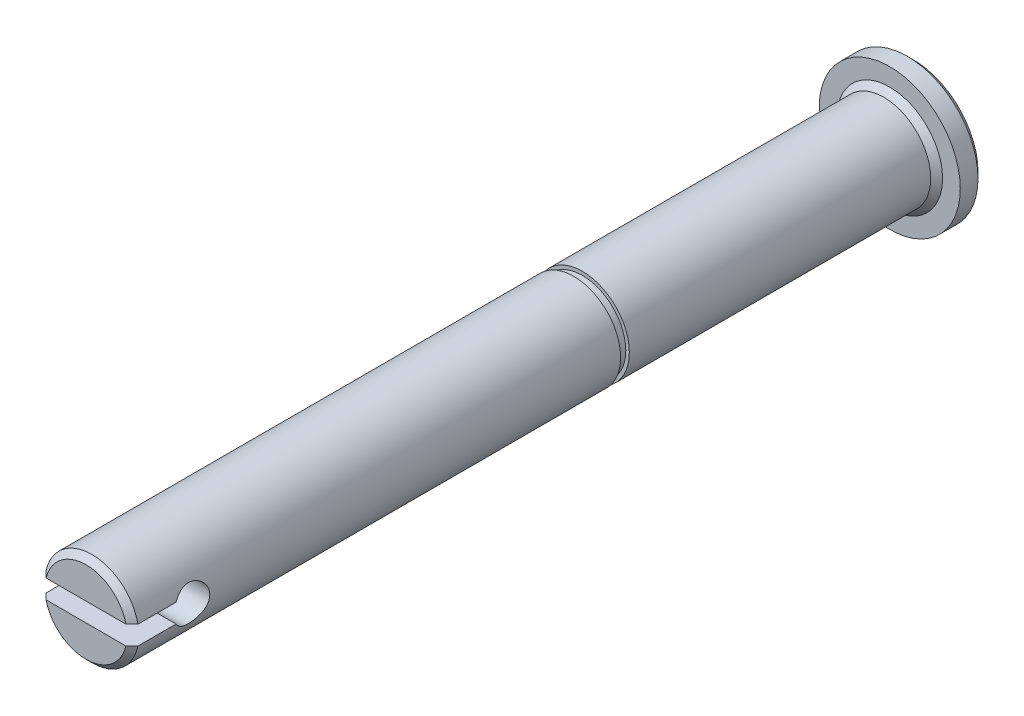
ISO-10303-21;
HEADER;
FILE_DESCRIPTION(('STEP AP214'),'2;1');
FILE_NAME('part.step','',(''),(''),'','','');
FILE_SCHEMA(('AUTOMOTIVE_DESIGN { 1 0 10303 214 1 1 1 1 }'));
ENDSEC;
DATA;
#1=APPLICATION_CONTEXT('core data for automotive mechanical design processes');
#2=APPLICATION_PROTOCOL_DEFINITION('international standard','automotive_design',2000,#1);
#3=PRODUCT_CONTEXT('',#1,'mechanical');
#4=PRODUCT('Part','Part','',(#3));
#5=PRODUCT_RELATED_PRODUCT_CATEGORY('part','',(#4));
#6=PRODUCT_DEFINITION_FORMATION('','',#4);
#7=PRODUCT_DEFINITION_CONTEXT('part definition',#1,'design');
#8=PRODUCT_DEFINITION('design','',#6,#7);
#9=PRODUCT_DEFINITION_SHAPE('','',#8);
#10=(LENGTH_UNIT() NAMED_UNIT(*) SI_UNIT(.MILLI.,.METRE.));
#11=(NAMED_UNIT(*) PLANE_ANGLE_UNIT() SI_UNIT($,.RADIAN.));
#12=(NAMED_UNIT(*) SI_UNIT($,.STERADIAN.) SOLID_ANGLE_UNIT());
#13=UNCERTAINTY_MEASURE_WITH_UNIT(LENGTH_MEASURE(1.E-05),#10,'distance_accuracy_value','');
#14=(GEOMETRIC_REPRESENTATION_CONTEXT(3) GLOBAL_UNCERTAINTY_ASSIGNED_CONTEXT((#13)) GLOBAL_UNIT_ASSIGNED_CONTEXT((#10,
#11,#12)) REPRESENTATION_CONTEXT('',''));
#15=CARTESIAN_POINT('',(0.,0.,0.));
#16=DIRECTION('',(0.,0.,1.));
#17=DIRECTION('',(1.,0.,0.));
#18=AXIS2_PLACEMENT_3D('',#15,#16,#17);
#19=CARTESIAN_POINT('',(0.,3.96874999999999,68.));
#20=DIRECTION('',(0.,0.,-1.));
#21=DIRECTION('',(-1.,0.,0.));
#22=AXIS2_PLACEMENT_3D('',#19,#20,#21);
#23=PLANE('',#22);
#24=DIRECTION('',(1.,0.,0.));
#25=VECTOR('',#24,1.);
#26=CARTESIAN_POINT('',(0.,0.79999999999999,68.));
#27=LINE('',#26,#25);
#28=CARTESIAN_POINT('',(-3.37523726017891,0.79999999999999,68.));
#29=VERTEX_POINT('',#28);
#30=CARTESIAN_POINT('',(3.37523726017891,0.79999999999999,68.));
#31=VERTEX_POINT('',#30);
#32=EDGE_CURVE('E169',#29,#31,#27,.T.);
#33=ORIENTED_EDGE('',*,*,#32,.T.);
#34=CARTESIAN_POINT('',(0.,0.,68.));
#35=DIRECTION('',(0.,0.,-1.));
#36=DIRECTION('',(-1.,0.,0.));
#37=AXIS2_PLACEMENT_3D('',#34,#35,#36);
#38=CIRCLE('',#37,3.46875000000001);
#39=EDGE_CURVE('E154',#31,#29,#38,.F.);
#40=ORIENTED_EDGE('',*,*,#39,.T.);
#41=EDGE_LOOP('',(#33,#40));
#42=FACE_BOUND('',#41,.T.);
#43=ADVANCED_FACE('F37',(#42),#23,.F.);
#44=CARTESIAN_POINT('',(0.,5.96875,0.));
#45=DIRECTION('',(0.,0.,-1.));
#46=DIRECTION('',(-1.,0.,0.));
#47=AXIS2_PLACEMENT_3D('',#44,#45,#46);
#48=PLANE('',#47);
#49=CARTESIAN_POINT('',(0.,0.,0.));
#50=DIRECTION('',(0.,0.,-1.));
#51=DIRECTION('',(-1.,0.,0.));
#52=AXIS2_PLACEMENT_3D('',#49,#50,#51);
#53=CIRCLE('',#52,4.46875000000001);
#54=CARTESIAN_POINT('',(-4.46875000000001,0.,0.));
#55=VERTEX_POINT('',#54);
#56=EDGE_CURVE('E196',#55,#55,#53,.T.);
#57=ORIENTED_EDGE('',*,*,#56,.T.);
#58=EDGE_LOOP('',(#57));
#59=FACE_BOUND('',#58,.T.);
#60=CARTESIAN_POINT('',(0.,0.,0.));
#61=DIRECTION('',(0.,0.,1.));
#62=DIRECTION('',(1.,0.,0.));
#63=AXIS2_PLACEMENT_3D('',#60,#61,#62);
#64=CIRCLE('',#63,5.96875);
#65=CARTESIAN_POINT('',(5.96875,0.,0.));
#66=VERTEX_POINT('',#65);
#67=EDGE_CURVE('E186',#66,#66,#64,.T.);
#68=ORIENTED_EDGE('',*,*,#67,.T.);
#69=EDGE_LOOP('',(#68));
#70=FACE_BOUND('',#69,.T.);
#71=ADVANCED_FACE('F215',(#59,#70),#48,.F.);
#72=CARTESIAN_POINT('',(0.,0.,100.107110911681));
#73=DIRECTION('',(0.,0.,1.));
#74=DIRECTION('',(1.,0.,0.));
#75=AXIS2_PLACEMENT_3D('',#72,#73,#74);
#76=CYLINDRICAL_SURFACE('',#75,5.96875);
#77=CARTESIAN_POINT('',(0.,0.,-1.5));
#78=DIRECTION('',(0.,0.,1.));
#79=DIRECTION('',(1.,0.,0.));
#80=AXIS2_PLACEMENT_3D('',#77,#78,#79);
#81=CIRCLE('',#80,5.96875);
#82=CARTESIAN_POINT('',(5.96875,0.,-1.5));
#83=VERTEX_POINT('',#82);
#84=EDGE_CURVE('E123',#83,#83,#81,.T.);
#85=ORIENTED_EDGE('',*,*,#84,.T.);
#86=EDGE_LOOP('',(#85));
#87=FACE_BOUND('',#86,.T.);
#88=ORIENTED_EDGE('',*,*,#67,.F.);
#89=EDGE_LOOP('',(#88));
#90=FACE_BOUND('',#89,.T.);
#91=ADVANCED_FACE('F218',(#87,#90),#76,.T.);
#92=CARTESIAN_POINT('',(0.,0.,-2.));
#93=DIRECTION('',(0.,0.,1.));
#94=DIRECTION('',(1.,0.,0.));
#95=AXIS2_PLACEMENT_3D('',#92,#93,#94);
#96=PLANE('',#95);
#97=CARTESIAN_POINT('',(0.,0.,-2.));
#98=DIRECTION('',(0.,0.,1.));
#99=DIRECTION('',(1.,0.,0.));
#100=AXIS2_PLACEMENT_3D('',#97,#98,#99);
#101=CIRCLE('',#100,5.46875);
#102=CARTESIAN_POINT('',(5.46875,0.,-2.));
#103=VERTEX_POINT('',#102);
#104=EDGE_CURVE('E361',#103,#103,#101,.F.);
#105=ORIENTED_EDGE('',*,*,#104,.T.);
#106=EDGE_LOOP('',(#105));
#107=FACE_BOUND('',#106,.T.);
#108=ADVANCED_FACE('F222',(#107),#96,.F.);
#109=DIRECTION('',(-1.,0.,0.));
#110=VECTOR('',#109,1.);
#111=CARTESIAN_POINT('',(0.,-0.80000000000001,68.));
#112=LINE('',#111,#110);
#113=CARTESIAN_POINT('',(3.37523726017891,-0.80000000000001,68.));
#114=VERTEX_POINT('',#113);
#115=CARTESIAN_POINT('',(-3.37523726017891,-0.80000000000001,68.));
#116=VERTEX_POINT('',#115);
#117=EDGE_CURVE('E171',#114,#116,#112,.T.);
#118=ORIENTED_EDGE('',*,*,#117,.T.);
#119=CARTESIAN_POINT('',(0.,0.,68.));
#120=DIRECTION('',(0.,0.,-1.));
#121=DIRECTION('',(-1.,0.,0.));
#122=AXIS2_PLACEMENT_3D('',#119,#120,#121);
#123=CIRCLE('',#122,3.46875000000001);
#124=EDGE_CURVE('E195',#116,#114,#123,.F.);
#125=ORIENTED_EDGE('',*,*,#124,.T.);
#126=EDGE_LOOP('',(#118,#125));
#127=FACE_BOUND('',#126,.T.);
#128=ADVANCED_FACE('F225',(#127),#23,.F.);
#129=CARTESIAN_POINT('',(0.,0.,100.107110911681));
#130=DIRECTION('',(0.,0.,1.));
#131=DIRECTION('',(1.,0.,0.));
#132=AXIS2_PLACEMENT_3D('',#129,#130,#131);
#133=CYLINDRICAL_SURFACE('',#132,3.96874999999999);
#134=DIRECTION('',(0.,0.,1.));
#135=VECTOR('',#134,1.);
#136=CARTESIAN_POINT('',(3.88728395701934,-0.800000000000011,100.107110911681));
#137=LINE('',#136,#135);
#138=CARTESIAN_POINT('',(3.88728395701934,-0.800000000000009,64.2688577540449));
#139=VERTEX_POINT('',#138);
#140=CARTESIAN_POINT('',(3.88728395701934,-0.800000000000011,67.5));
#141=VERTEX_POINT('',#140);
#142=EDGE_CURVE('E96',#139,#141,#137,.T.);
#143=ORIENTED_EDGE('',*,*,#142,.T.);
#144=CARTESIAN_POINT('',(0.,0.,67.5));
#145=DIRECTION('',(0.,0.,-1.));
#146=DIRECTION('',(-1.,0.,0.));
#147=AXIS2_PLACEMENT_3D('',#144,#145,#146);
#148=CIRCLE('',#147,3.96874999999999);
#149=CARTESIAN_POINT('',(-3.88728395701934,-0.800000000000011,67.5));
#150=VERTEX_POINT('',#149);
#151=EDGE_CURVE('E152',#141,#150,#148,.T.);
#152=ORIENTED_EDGE('',*,*,#151,.T.);
#153=DIRECTION('',(0.,0.,1.));
#154=VECTOR('',#153,1.);
#155=CARTESIAN_POINT('',(-3.88728395701934,-0.800000000000011,100.107110911681));
#156=LINE('',#155,#154);
#157=CARTESIAN_POINT('',(-3.88728395701934,-0.800000000000011,64.2688577540449));
#158=VERTEX_POINT('',#157);
#159=EDGE_CURVE('E148',#150,#158,#156,.F.);
#160=ORIENTED_EDGE('',*,*,#159,.T.);
#161=CARTESIAN_POINT('',(-3.96874999999999,0.,61.5));
#162=CARTESIAN_POINT('',(-3.96875235290516,0.0811895662637415,61.4999968772154));
#163=CARTESIAN_POINT('',(-3.96623705766983,0.162357921487685,61.5066122718395));
#164=CARTESIAN_POINT('',(-3.95645475273768,0.32226639534504,61.5327899384606));
#165=CARTESIAN_POINT('',(-3.9491885098131,0.401006903670208,61.5523501212586));
#166=CARTESIAN_POINT('',(-3.93068352240348,0.553730230722942,61.6036250877012));
#167=CARTESIAN_POINT('',(-3.91945251815966,0.627721989965594,61.6353161987242));
#168=CARTESIAN_POINT('',(-3.89413463330518,0.769332798178141,61.7098320311838));
#169=CARTESIAN_POINT('',(-3.88004697431348,0.836950102865169,61.7526597880328));
#170=CARTESIAN_POINT('',(-3.84979049984029,0.966803087002946,61.8501576981711));
#171=CARTESIAN_POINT('',(-3.83356214553767,1.02872818631156,61.9052228452228));
#172=CARTESIAN_POINT('',(-3.80114392991388,1.14271589452629,62.0247939167751));
#173=CARTESIAN_POINT('',(-3.78495408220867,1.19477541493016,62.0893027865465));
#174=CARTESIAN_POINT('',(-3.75375024506948,1.28954488842556,62.2289830004365));
#175=CARTESIAN_POINT('',(-3.73880630154341,1.33181343188944,62.3044710500179));
#176=CARTESIAN_POINT('',(-3.71271431278374,1.40291631405747,62.4621380051603));
#177=CARTESIAN_POINT('',(-3.70156472459191,1.43175611526283,62.5443141741406));
#178=CARTESIAN_POINT('',(-3.68496120022275,1.47395231237403,62.709447445295));
#179=CARTESIAN_POINT('',(-3.67928991508794,1.48790209905784,62.7922303210205));
#180=CARTESIAN_POINT('',(-3.67364979093226,1.50177746986018,62.9591412802628));
#181=CARTESIAN_POINT('',(-3.67367854879762,1.50170896403055,63.0432687819329));
#182=CARTESIAN_POINT('',(-3.67924809247516,1.48800295949633,63.2050210662859));
#183=CARTESIAN_POINT('',(-3.68445282975388,1.4751927050225,63.2827296753833));
#184=CARTESIAN_POINT('',(-3.6992287706265,1.43773576808188,63.4347992169265));
#185=CARTESIAN_POINT('',(-3.7088006424486,1.41308727418059,63.5091596351418));
#186=CARTESIAN_POINT('',(-3.73143204981506,1.35220545280547,63.6540937531143));
#187=CARTESIAN_POINT('',(-3.74455472376801,1.31575979266568,63.7245679652726));
#188=CARTESIAN_POINT('',(-3.77278855099052,1.23246632306053,63.858638801486));
#189=CARTESIAN_POINT('',(-3.78790039764494,1.185614882421,63.9222330131655));
#190=CARTESIAN_POINT('',(-3.81966972696529,1.07906958052788,64.045311893191));
#191=CARTESIAN_POINT('',(-3.83636225242781,1.01871677875675,64.1042185041687));
#192=CARTESIAN_POINT('',(-3.86852521005012,0.888798736012353,64.211247876739));
#193=CARTESIAN_POINT('',(-3.88399544814842,0.819232036830465,64.2593689281367));
#194=CARTESIAN_POINT('',(-3.91228702236225,0.67136752044109,64.3441123258633));
#195=CARTESIAN_POINT('',(-3.9250622359204,0.592948270637902,64.3805392874427));
#196=CARTESIAN_POINT('',(-3.94618146958171,0.430491416681559,64.4394910694469));
#197=CARTESIAN_POINT('',(-3.95452748998417,0.346456368058671,64.4620221662283));
#198=CARTESIAN_POINT('',(-3.96549485571463,0.180016133563489,64.4914247025724));
#199=CARTESIAN_POINT('',(-3.96840038033801,0.0977670316905002,64.4990743733315));
#200=CARTESIAN_POINT('',(-3.96903953066591,-0.0668815726788234,64.5007666374635));
#201=CARTESIAN_POINT('',(-3.96677432466809,-0.149281036998285,64.4948123045847));
#202=CARTESIAN_POINT('',(-3.95751387765711,-0.308509449759617,64.4700549512486));
#203=CARTESIAN_POINT('',(-3.95070733758842,-0.385430179731121,64.4517642138688));
#204=CARTESIAN_POINT('',(-3.93323922421604,-0.535054943698497,64.4035303660737));
#205=CARTESIAN_POINT('',(-3.92257714983916,-0.607758428186658,64.3735857410565));
#206=CARTESIAN_POINT('',(-3.89805709582781,-0.749293839452984,64.3019356228174));
#207=CARTESIAN_POINT('',(-3.88411397934764,-0.817947851381652,64.2599087125275));
#208=CARTESIAN_POINT('',(-3.85457060094959,-0.947460662876724,64.1656495286557));
#209=CARTESIAN_POINT('',(-3.83896972149388,-1.00831653878511,64.1134134459027));
#210=CARTESIAN_POINT('',(-3.80668516235517,-1.12425932967485,63.9965965455812));
#211=CARTESIAN_POINT('',(-3.78999186574345,-1.17879469273785,63.9314695358118));
#212=CARTESIAN_POINT('',(-3.75828883961382,-1.27627448044843,63.7926636825941));
#213=CARTESIAN_POINT('',(-3.74327927439558,-1.31921777450794,63.7189840059956));
#214=CARTESIAN_POINT('',(-3.71669682150846,-1.39236165655324,63.5645023051839));
#215=CARTESIAN_POINT('',(-3.70514050938396,-1.42250106863542,63.483668268971));
#216=CARTESIAN_POINT('',(-3.68713902122079,-1.46853846344092,63.3175123828117));
#217=CARTESIAN_POINT('',(-3.68069061489655,-1.48444544770552,63.2321934056506));
#218=CARTESIAN_POINT('',(-3.67406859124913,-1.50075537098888,63.0654766110112));
#219=CARTESIAN_POINT('',(-3.67351359320033,-1.50210075403818,62.9841854002844));
#220=CARTESIAN_POINT('',(-3.67776100954736,-1.49167077450226,62.8225996022465));
#221=CARTESIAN_POINT('',(-3.68256289906448,-1.4798966973885,62.742304918073));
#222=CARTESIAN_POINT('',(-3.6966633489412,-1.44430014361456,62.5875615547264));
#223=CARTESIAN_POINT('',(-3.70581551301211,-1.42086883834244,62.5130084010148));
#224=CARTESIAN_POINT('',(-3.72749788238074,-1.36296991704813,62.3688494855174));
#225=CARTESIAN_POINT('',(-3.74002894782577,-1.32849949044101,62.2992449891919));
#226=CARTESIAN_POINT('',(-3.76788350011339,-1.24738118136543,62.1629463202439));
#227=CARTESIAN_POINT('',(-3.78331980495464,-1.20018460805903,62.0966020503516));
#228=CARTESIAN_POINT('',(-3.8148623574172,-1.09579755120322,61.9724743553616));
#229=CARTESIAN_POINT('',(-3.83096881840431,-1.03860386590997,61.9146936838893));
#230=CARTESIAN_POINT('',(-3.8631072359189,-0.912065587312115,61.8060721580893));
#231=CARTESIAN_POINT('',(-3.87908578141514,-0.842223839502105,61.7557920321796));
#232=CARTESIAN_POINT('',(-3.90823244171208,-0.694519841410888,61.6676950415757));
#233=CARTESIAN_POINT('',(-3.9214002616272,-0.616656750844594,61.6298794843681));
#234=CARTESIAN_POINT('',(-3.94397379095297,-0.450963223759717,61.5665147017237));
#235=CARTESIAN_POINT('',(-3.95315854139378,-0.362829106071727,61.5416731228939));
#236=CARTESIAN_POINT('',(-3.96554375616128,-0.183119787473436,61.5084218250262));
#237=CARTESIAN_POINT('',(-3.96874734694947,-0.0915464098791727,61.5000035211386));
#238=CARTESIAN_POINT('',(-3.96874999999999,0.,61.5));
#239=B_SPLINE_CURVE_WITH_KNOTS('',3,(#161,#162,#163,#164,#165,#166,#167,#168,#169,#170,#171,
#172,#173,#174,#175,#176,#177,#178,#179,#180,#181,#182,#183,#184,#185,#186,#187,#188,#189,#190,
#191,#192,#193,#194,#195,#196,#197,#198,#199,#200,#201,#202,#203,#204,#205,#206,#207,#208,#209,
#210,#211,#212,#213,#214,#215,#216,#217,#218,#219,#220,#221,#222,#223,#224,#225,#226,#227,#228,
#229,#230,#231,#232,#233,#234,#235,#236,#237,#238),.UNSPECIFIED.,.T.,.F.,(4,2,2,2,2,2,2,2,2,2,2,
2,2,2,2,2,2,2,2,2,2,2,2,2,2,2,2,2,2,2,2,2,2,2,2,2,2,2,4),(0.,0.243230980917179,0.48642271561379,
0.729142278974682,0.971928067626436,1.22413347175535,1.47641770094006,1.73849571925369,
2.00046703696857,2.25155656129105,2.50254022756812,2.73822718578199,2.97395021925657,
3.21417676666975,3.4544872749935,3.71122442500585,3.9680022553791,4.22887053577967,
4.4896209031336,4.73632405339019,4.98297146796736,5.219960216672,5.45697977599901,
5.70100400190114,5.94511945074101,6.20362534055543,6.46215643365047,6.72190924112969,
6.98149764715492,7.22417632234878,7.46683122148185,7.70184317477259,7.93691501026436,
8.18444877254152,8.43206195742678,8.69337294409259,8.95471133258409,9.22911323889271,
9.50337167010565),.UNSPECIFIED.);
#240=CARTESIAN_POINT('',(-3.88728395701934,0.79999999999999,64.2688577540449));
#241=VERTEX_POINT('',#240);
#242=EDGE_CURVE('E116',#158,#241,#239,.T.);
#243=ORIENTED_EDGE('',*,*,#242,.T.);
#244=DIRECTION('',(0.,0.,1.));
#245=VECTOR('',#244,1.);
#246=CARTESIAN_POINT('',(-3.88728395701934,0.79999999999999,100.107110911681));
#247=LINE('',#246,#245);
#248=CARTESIAN_POINT('',(-3.88728395701934,0.79999999999999,67.5));
#249=VERTEX_POINT('',#248);
#250=EDGE_CURVE('E108',#241,#249,#247,.T.);
#251=ORIENTED_EDGE('',*,*,#250,.T.);
#252=CARTESIAN_POINT('',(0.,0.,67.5));
#253=DIRECTION('',(0.,0.,-1.));
#254=DIRECTION('',(-1.,0.,0.));
#255=AXIS2_PLACEMENT_3D('',#252,#253,#254);
#256=CIRCLE('',#255,3.96874999999999);
#257=CARTESIAN_POINT('',(3.88728395701934,0.79999999999999,67.5));
#258=VERTEX_POINT('',#257);
#259=EDGE_CURVE('E151',#249,#258,#256,.T.);
#260=ORIENTED_EDGE('',*,*,#259,.T.);
#261=DIRECTION('',(0.,0.,1.));
#262=VECTOR('',#261,1.);
#263=CARTESIAN_POINT('',(3.88728395701934,0.79999999999999,100.107110911681));
#264=LINE('',#263,#262);
#265=CARTESIAN_POINT('',(3.88728395701934,0.79999999999999,64.2688577540449));
#266=VERTEX_POINT('',#265);
#267=EDGE_CURVE('E121',#258,#266,#264,.F.);
#268=ORIENTED_EDGE('',*,*,#267,.T.);
#269=CARTESIAN_POINT('',(3.96874999999999,0.,61.5));
#270=CARTESIAN_POINT('',(3.96875235290516,-0.0811895662637508,61.4999968772154));
#271=CARTESIAN_POINT('',(3.96623705766983,-0.162357921487695,61.5066122718395));
#272=CARTESIAN_POINT('',(3.95645475273768,-0.322266395345049,61.5327899384606));
#273=CARTESIAN_POINT('',(3.9491885098131,-0.401006903670218,61.5523501212586));
#274=CARTESIAN_POINT('',(3.93068352240348,-0.553730230722953,61.6036250877012));
#275=CARTESIAN_POINT('',(3.91945251815966,-0.627721989965606,61.6353161987242));
#276=CARTESIAN_POINT('',(3.89413463330518,-0.769332798178154,61.7098320311838));
#277=CARTESIAN_POINT('',(3.88004697431347,-0.836950102865181,61.7526597880328));
#278=CARTESIAN_POINT('',(3.84979049984029,-0.966803087002959,61.8501576981711));
#279=CARTESIAN_POINT('',(3.83356214553767,-1.02872818631158,61.9052228452228));
#280=CARTESIAN_POINT('',(3.80114392991388,-1.14271589452631,62.0247939167751));
#281=CARTESIAN_POINT('',(3.78495408220866,-1.19477541493017,62.0893027865465));
#282=CARTESIAN_POINT('',(3.75375024506947,-1.28954488842557,62.2289830004365));
#283=CARTESIAN_POINT('',(3.7388063015434,-1.33181343188945,62.3044710500179));
#284=CARTESIAN_POINT('',(3.71271431278373,-1.40291631405749,62.4621380051603));
#285=CARTESIAN_POINT('',(3.7015647245919,-1.43175611526285,62.5443141741406));
#286=CARTESIAN_POINT('',(3.68496120022274,-1.47395231237405,62.709447445295));
#287=CARTESIAN_POINT('',(3.67928991508793,-1.48790209905786,62.7922303210205));
#288=CARTESIAN_POINT('',(3.67364979093226,-1.5017774698602,62.9591412802628));
#289=CARTESIAN_POINT('',(3.67367854879761,-1.50170896403056,63.0432687819329));
#290=CARTESIAN_POINT('',(3.67924809247515,-1.48800295949635,63.2050210662859));
#291=CARTESIAN_POINT('',(3.68445282975387,-1.47519270502252,63.2827296753833));
#292=CARTESIAN_POINT('',(3.69922877062649,-1.4377357680819,63.4347992169265));
#293=CARTESIAN_POINT('',(3.70880064244859,-1.41308727418061,63.5091596351418));
#294=CARTESIAN_POINT('',(3.73143204981505,-1.3522054528055,63.6540937531143));
#295=CARTESIAN_POINT('',(3.744554723768,-1.31575979266571,63.7245679652726));
#296=CARTESIAN_POINT('',(3.77278855099051,-1.23246632306056,63.8586388014859));
#297=CARTESIAN_POINT('',(3.78790039764493,-1.18561488242103,63.9222330131655));
#298=CARTESIAN_POINT('',(3.81966972696528,-1.07906958052792,64.045311893191));
#299=CARTESIAN_POINT('',(3.8363622524278,-1.01871677875679,64.1042185041687));
#300=CARTESIAN_POINT('',(3.86852521005012,-0.888798736012388,64.211247876739));
#301=CARTESIAN_POINT('',(3.88399544814841,-0.819232036830498,64.2593689281367));
#302=CARTESIAN_POINT('',(3.91228702236225,-0.671367520441117,64.3441123258633));
#303=CARTESIAN_POINT('',(3.9250622359204,-0.592948270637927,64.3805392874427));
#304=CARTESIAN_POINT('',(3.9461814695817,-0.430491416681583,64.4394910694469));
#305=CARTESIAN_POINT('',(3.95452748998416,-0.346456368058697,64.4620221662283));
#306=CARTESIAN_POINT('',(3.96549485571462,-0.180016133563516,64.4914247025724));
#307=CARTESIAN_POINT('',(3.96840038033801,-0.0977670316905254,64.4990743733315));
#308=CARTESIAN_POINT('',(3.96903953066591,0.0668815726788,64.5007666374635));
#309=CARTESIAN_POINT('',(3.96677432466809,0.149281036998262,64.4948123045847));
#310=CARTESIAN_POINT('',(3.95751387765711,0.308509449759594,64.4700549512486));
#311=CARTESIAN_POINT('',(3.95070733758842,0.385430179731098,64.4517642138688));
#312=CARTESIAN_POINT('',(3.93323922421605,0.535054943698473,64.4035303660737));
#313=CARTESIAN_POINT('',(3.92257714983917,0.607758428186632,64.3735857410565));
#314=CARTESIAN_POINT('',(3.89805709582781,0.749293839452958,64.3019356228174));
#315=CARTESIAN_POINT('',(3.88411397934764,0.817947851381628,64.2599087125275));
#316=CARTESIAN_POINT('',(3.8545706009496,0.947460662876701,64.1656495286557));
#317=CARTESIAN_POINT('',(3.83896972149388,1.00831653878508,64.1134134459027));
#318=CARTESIAN_POINT('',(3.80668516235518,1.12425932967482,63.9965965455812));
#319=CARTESIAN_POINT('',(3.78999186574346,1.17879469273782,63.9314695358118));
#320=CARTESIAN_POINT('',(3.75828883961383,1.2762744804484,63.7926636825941));
#321=CARTESIAN_POINT('',(3.74327927439559,1.31921777450791,63.7189840059957));
#322=CARTESIAN_POINT('',(3.71669682150846,1.39236165655322,63.5645023051839));
#323=CARTESIAN_POINT('',(3.70514050938397,1.4225010686354,63.483668268971));
#324=CARTESIAN_POINT('',(3.6871390212208,1.46853846344089,63.3175123828117));
#325=CARTESIAN_POINT('',(3.68069061489656,1.4844454477055,63.2321934056506));
#326=CARTESIAN_POINT('',(3.67406859124914,1.50075537098886,63.0654766110112));
#327=CARTESIAN_POINT('',(3.67351359320033,1.50210075403816,62.9841854002845));
#328=CARTESIAN_POINT('',(3.67776100954737,1.49167077450225,62.8225996022465));
#329=CARTESIAN_POINT('',(3.68256289906449,1.47989669738849,62.742304918073));
#330=CARTESIAN_POINT('',(3.6966633489412,1.44430014361455,62.5875615547264));
#331=CARTESIAN_POINT('',(3.70581551301211,1.42086883834242,62.5130084010148));
#332=CARTESIAN_POINT('',(3.72749788238074,1.36296991704812,62.3688494855174));
#333=CARTESIAN_POINT('',(3.74002894782577,1.32849949044099,62.2992449891919));
#334=CARTESIAN_POINT('',(3.7678835001134,1.24738118136541,62.1629463202439));
#335=CARTESIAN_POINT('',(3.78331980495464,1.20018460805901,62.0966020503516));
#336=CARTESIAN_POINT('',(3.8148623574172,1.0957975512032,61.9724743553616));
#337=CARTESIAN_POINT('',(3.83096881840431,1.03860386590996,61.9146936838893));
#338=CARTESIAN_POINT('',(3.8631072359189,0.912065587312105,61.8060721580893));
#339=CARTESIAN_POINT('',(3.87908578141514,0.842223839502096,61.7557920321796));
#340=CARTESIAN_POINT('',(3.90823244171208,0.694519841410882,61.6676950415757));
#341=CARTESIAN_POINT('',(3.9214002616272,0.616656750844589,61.6298794843681));
#342=CARTESIAN_POINT('',(3.94397379095297,0.450963223759712,61.5665147017237));
#343=CARTESIAN_POINT('',(3.95315854139378,0.36282910607172,61.5416731228939));
#344=CARTESIAN_POINT('',(3.96554375616128,0.183119787473428,61.5084218250262));
#345=CARTESIAN_POINT('',(3.96874734694947,0.0915464098791641,61.5000035211386));
#346=CARTESIAN_POINT('',(3.96874999999999,0.,61.5));
#347=B_SPLINE_CURVE_WITH_KNOTS('',3,(#269,#270,#271,#272,#273,#274,#275,#276,#277,#278,#279,
#280,#281,#282,#283,#284,#285,#286,#287,#288,#289,#290,#291,#292,#293,#294,#295,#296,#297,#298,
#299,#300,#301,#302,#303,#304,#305,#306,#307,#308,#309,#310,#311,#312,#313,#314,#315,#316,#317,
#318,#319,#320,#321,#322,#323,#324,#325,#326,#327,#328,#329,#330,#331,#332,#333,#334,#335,#336,
#337,#338,#339,#340,#341,#342,#343,#344,#345,#346),.UNSPECIFIED.,.T.,.F.,(4,2,2,2,2,2,2,2,2,2,2,
2,2,2,2,2,2,2,2,2,2,2,2,2,2,2,2,2,2,2,2,2,2,2,2,2,2,2,4),(0.,0.24323098091718,0.486422715613791,
0.729142278974683,0.971928067626436,1.22413347175535,1.47641770094006,1.7384957192537,
2.00046703696858,2.25155656129106,2.50254022756812,2.73822718578199,2.97395021925656,
3.21417676666973,3.45448727499349,3.71122442500584,3.9680022553791,4.22887053577967,
4.4896209031336,4.73632405339019,4.98297146796737,5.219960216672,5.45697977599901,
5.70100400190115,5.94511945074101,6.20362534055541,6.46215643365046,6.72190924112968,
6.98149764715492,7.22417632234876,7.46683122148184,7.70184317477259,7.93691501026436,
8.18444877254152,8.43206195742678,8.69337294409258,8.95471133258408,9.22911323889271,
9.50337167010565),.UNSPECIFIED.);
#348=EDGE_CURVE('E107',#266,#139,#347,.T.);
#349=ORIENTED_EDGE('',*,*,#348,.T.);
#350=EDGE_LOOP('',(#143,#152,#160,#243,#251,#260,#268,#349));
#351=FACE_BOUND('',#350,.T.);
#352=CARTESIAN_POINT('',(0.,0.,26.7366));
#353=DIRECTION('',(0.,0.,1.));
#354=DIRECTION('',(1.,0.,0.));
#355=AXIS2_PLACEMENT_3D('',#352,#353,#354);
#356=CIRCLE('',#355,3.96875);
#357=CARTESIAN_POINT('',(3.96875,0.,26.7366));
#358=VERTEX_POINT('',#357);
#359=EDGE_CURVE('E184',#358,#358,#356,.T.);
#360=ORIENTED_EDGE('',*,*,#359,.T.);
#361=EDGE_LOOP('',(#360));
#362=FACE_BOUND('',#361,.T.);
#363=ADVANCED_FACE('F119',(#351,#362),#133,.T.);
#364=CARTESIAN_POINT('',(0.,3.668,26.7366));
#365=DIRECTION('',(0.,0.,1.));
#366=DIRECTION('',(1.,0.,0.));
#367=AXIS2_PLACEMENT_3D('',#364,#365,#366);
#368=PLANE('',#367);
#369=ORIENTED_EDGE('',*,*,#359,.F.);
#370=EDGE_LOOP('',(#369));
#371=FACE_BOUND('',#370,.T.);
#372=CARTESIAN_POINT('',(0.,0.,26.7366));
#373=DIRECTION('',(0.,0.,1.));
#374=DIRECTION('',(1.,0.,0.));
#375=AXIS2_PLACEMENT_3D('',#372,#373,#374);
#376=CIRCLE('',#375,3.668);
#377=CARTESIAN_POINT('',(3.668,0.,26.7366));
#378=VERTEX_POINT('',#377);
#379=EDGE_CURVE('E181',#378,#378,#376,.T.);
#380=ORIENTED_EDGE('',*,*,#379,.T.);
#381=EDGE_LOOP('',(#380));
#382=FACE_BOUND('',#381,.T.);
#383=ADVANCED_FACE('F232',(#371,#382),#368,.F.);
#384=CARTESIAN_POINT('',(0.,0.,100.107110911681));
#385=DIRECTION('',(0.,0.,1.));
#386=DIRECTION('',(1.,0.,0.));
#387=AXIS2_PLACEMENT_3D('',#384,#385,#386);
#388=CYLINDRICAL_SURFACE('',#387,3.668);
#389=ORIENTED_EDGE('',*,*,#379,.F.);
#390=EDGE_LOOP('',(#389));
#391=FACE_BOUND('',#390,.T.);
#392=CARTESIAN_POINT('',(0.,0.,26.));
#393=DIRECTION('',(0.,0.,1.));
#394=DIRECTION('',(1.,0.,0.));
#395=AXIS2_PLACEMENT_3D('',#392,#393,#394);
#396=CIRCLE('',#395,3.668);
#397=CARTESIAN_POINT('',(3.668,0.,26.));
#398=VERTEX_POINT('',#397);
#399=EDGE_CURVE('E174',#398,#398,#396,.T.);
#400=ORIENTED_EDGE('',*,*,#399,.T.);
#401=EDGE_LOOP('',(#400));
#402=FACE_BOUND('',#401,.T.);
#403=ADVANCED_FACE('F324',(#391,#402),#388,.T.);
#404=CARTESIAN_POINT('',(0.,3.96875,26.));
#405=DIRECTION('',(0.,0.,-1.));
#406=DIRECTION('',(-1.,0.,0.));
#407=AXIS2_PLACEMENT_3D('',#404,#405,#406);
#408=PLANE('',#407);
#409=ORIENTED_EDGE('',*,*,#399,.F.);
#410=EDGE_LOOP('',(#409));
#411=FACE_BOUND('',#410,.T.);
#412=CARTESIAN_POINT('',(0.,0.,26.));
#413=DIRECTION('',(0.,0.,1.));
#414=DIRECTION('',(1.,0.,0.));
#415=AXIS2_PLACEMENT_3D('',#412,#413,#414);
#416=CIRCLE('',#415,3.96875);
#417=CARTESIAN_POINT('',(3.96875,0.,26.));
#418=VERTEX_POINT('',#417);
#419=EDGE_CURVE('E170',#418,#418,#416,.T.);
#420=ORIENTED_EDGE('',*,*,#419,.T.);
#421=EDGE_LOOP('',(#420));
#422=FACE_BOUND('',#421,.T.);
#423=ADVANCED_FACE('F271',(#411,#422),#408,.F.);
#424=CARTESIAN_POINT('',(0.,0.,100.107110911681));
#425=DIRECTION('',(0.,0.,1.));
#426=DIRECTION('',(1.,0.,0.));
#427=AXIS2_PLACEMENT_3D('',#424,#425,#426);
#428=CYLINDRICAL_SURFACE('',#427,3.96875);
#429=CARTESIAN_POINT('',(0.,0.,0.500000000000014));
#430=DIRECTION('',(0.,0.,-1.));
#431=DIRECTION('',(-1.,0.,0.));
#432=AXIS2_PLACEMENT_3D('',#429,#430,#431);
#433=CIRCLE('',#432,3.96875);
#434=CARTESIAN_POINT('',(-3.96875,0.,0.500000000000014));
#435=VERTEX_POINT('',#434);
#436=EDGE_CURVE('E359',#435,#435,#433,.F.);
#437=ORIENTED_EDGE('',*,*,#436,.T.);
#438=EDGE_LOOP('',(#437));
#439=FACE_BOUND('',#438,.T.);
#440=ORIENTED_EDGE('',*,*,#419,.F.);
#441=EDGE_LOOP('',(#440));
#442=FACE_BOUND('',#441,.T.);
#443=ADVANCED_FACE('F266',(#439,#442),#428,.T.);
#444=CARTESIAN_POINT('',(-5.96875,0.79999999999999,69.5615262877962));
#445=DIRECTION('',(0.,1.,0.));
#446=DIRECTION('',(0.,0.,1.));
#447=AXIS2_PLACEMENT_3D('',#444,#445,#446);
#448=PLANE('',#447);
#449=ORIENTED_EDGE('',*,*,#32,.F.);
#450=CARTESIAN_POINT('',(-3.37523726017891,0.79999999999999,68.));
#451=CARTESIAN_POINT('',(-3.46071494467348,0.79999999999999,67.9168065177094));
#452=CARTESIAN_POINT('',(-3.5461243469139,0.79999999999999,67.8335431080134));
#453=CARTESIAN_POINT('',(-3.71680657918172,0.79999999999999,67.6668764413341));
#454=CARTESIAN_POINT('',(-3.80207940922144,0.79999999999999,67.5834731843634));
#455=CARTESIAN_POINT('',(-3.88728395701935,0.79999999999999,67.5));
#456=B_SPLINE_CURVE_WITH_KNOTS('',3,(#450,#451,#452,#453,#454,#455),.UNSPECIFIED.,.F.,.F.,(4,2,
4),(0.,0.357838025463236,0.71567601862031),.UNSPECIFIED.);
#457=EDGE_CURVE('E11',#29,#249,#456,.T.);
#458=ORIENTED_EDGE('',*,*,#457,.T.);
#459=ORIENTED_EDGE('',*,*,#250,.F.);
#460=DIRECTION('',(1.,0.,0.));
#461=VECTOR('',#460,1.);
#462=CARTESIAN_POINT('',(-5.96875,0.79999999999999,64.2688577540449));
#463=LINE('',#462,#461);
#464=EDGE_CURVE('E117',#241,#266,#463,.T.);
#465=ORIENTED_EDGE('',*,*,#464,.T.);
#466=ORIENTED_EDGE('',*,*,#267,.F.);
#467=CARTESIAN_POINT('',(3.88728395701934,0.79999999999999,67.5));
#468=CARTESIAN_POINT('',(3.80207940922144,0.79999999999999,67.5834731843634));
#469=CARTESIAN_POINT('',(3.71680657918172,0.79999999999999,67.6668764413341));
#470=CARTESIAN_POINT('',(3.5461243469139,0.79999999999999,67.8335431080134));
#471=CARTESIAN_POINT('',(3.46071494467349,0.79999999999999,67.9168065177094));
#472=CARTESIAN_POINT('',(3.37523726017892,0.79999999999999,68.));
#473=B_SPLINE_CURVE_WITH_KNOTS('',3,(#467,#468,#469,#470,#471,#472),.UNSPECIFIED.,.F.,.F.,(4,2,
4),(0.,0.357837993157073,0.715676018620306),.UNSPECIFIED.);
#474=EDGE_CURVE('E51',#258,#31,#473,.T.);
#475=ORIENTED_EDGE('',*,*,#474,.T.);
#476=EDGE_LOOP('',(#449,#458,#459,#465,#466,#475));
#477=FACE_BOUND('',#476,.T.);
#478=ADVANCED_FACE('F138',(#477),#448,.F.);
#479=CARTESIAN_POINT('',(-5.96875,0.,63.));
#480=DIRECTION('',(1.,0.,0.));
#481=DIRECTION('',(0.,0.,-1.));
#482=AXIS2_PLACEMENT_3D('',#479,#480,#481);
#483=CYLINDRICAL_SURFACE('',#482,1.5);
#484=ORIENTED_EDGE('',*,*,#464,.F.);
#485=ORIENTED_EDGE('',*,*,#242,.F.);
#486=DIRECTION('',(1.,0.,0.));
#487=VECTOR('',#486,1.);
#488=CARTESIAN_POINT('',(-5.96875,-0.800000000000009,64.2688577540449));
#489=LINE('',#488,#487);
#490=EDGE_CURVE('E101',#158,#139,#489,.T.);
#491=ORIENTED_EDGE('',*,*,#490,.T.);
#492=ORIENTED_EDGE('',*,*,#348,.F.);
#493=EDGE_LOOP('',(#484,#485,#491,#492));
#494=FACE_BOUND('',#493,.T.);
#495=ADVANCED_FACE('F113',(#494),#483,.F.);
#496=CARTESIAN_POINT('',(-5.96875,-0.80000000000001,69.5615262877962));
#497=DIRECTION('',(0.,-1.,0.));
#498=DIRECTION('',(0.,0.,-1.));
#499=AXIS2_PLACEMENT_3D('',#496,#497,#498);
#500=PLANE('',#499);
#501=ORIENTED_EDGE('',*,*,#117,.F.);
#502=CARTESIAN_POINT('',(3.37523726017891,-0.80000000000001,68.));
#503=CARTESIAN_POINT('',(3.46071494467348,-0.80000000000001,67.9168065177094));
#504=CARTESIAN_POINT('',(3.5461243469139,-0.80000000000001,67.8335431080134));
#505=CARTESIAN_POINT('',(3.71680657918171,-0.80000000000001,67.6668764413341));
#506=CARTESIAN_POINT('',(3.80207940922144,-0.80000000000001,67.5834731843634));
#507=CARTESIAN_POINT('',(3.88728395701934,-0.80000000000001,67.5));
#508=B_SPLINE_CURVE_WITH_KNOTS('',3,(#502,#503,#504,#505,#506,#507),.UNSPECIFIED.,.F.,.F.,(4,2,
4),(0.,0.357838025463236,0.71567601862031),.UNSPECIFIED.);
#509=EDGE_CURVE('E103',#114,#141,#508,.T.);
#510=ORIENTED_EDGE('',*,*,#509,.T.);
#511=ORIENTED_EDGE('',*,*,#142,.F.);
#512=ORIENTED_EDGE('',*,*,#490,.F.);
#513=ORIENTED_EDGE('',*,*,#159,.F.);
#514=CARTESIAN_POINT('',(-3.88728395701934,-0.800000000000011,67.5));
#515=CARTESIAN_POINT('',(-3.80207940922144,-0.800000000000011,67.5834731843634));
#516=CARTESIAN_POINT('',(-3.71680657918171,-0.80000000000001,67.6668764413341));
#517=CARTESIAN_POINT('',(-3.5461243469139,-0.80000000000001,67.8335431080134));
#518=CARTESIAN_POINT('',(-3.46071494467348,-0.80000000000001,67.9168065177094));
#519=CARTESIAN_POINT('',(-3.37523726017891,-0.80000000000001,68.));
#520=B_SPLINE_CURVE_WITH_KNOTS('',3,(#514,#515,#516,#517,#518,#519),.UNSPECIFIED.,.F.,.F.,(4,2,
4),(0.,0.357837993157073,0.715676018620306),.UNSPECIFIED.);
#521=EDGE_CURVE('E156',#150,#116,#520,.T.);
#522=ORIENTED_EDGE('',*,*,#521,.T.);
#523=EDGE_LOOP('',(#501,#510,#511,#512,#513,#522));
#524=FACE_BOUND('',#523,.T.);
#525=ADVANCED_FACE('F99',(#524),#500,.F.);
#526=CARTESIAN_POINT('',(0.,0.,-1.5));
#527=DIRECTION('',(0.,0.,1.));
#528=DIRECTION('',(1.,0.,0.));
#529=AXIS2_PLACEMENT_3D('',#526,#527,#528);
#530=CONICAL_SURFACE('',#529,5.96875,0.785398163397447);
#531=ORIENTED_EDGE('',*,*,#104,.F.);
#532=EDGE_LOOP('',(#531));
#533=FACE_BOUND('',#532,.T.);
#534=ORIENTED_EDGE('',*,*,#84,.F.);
#535=EDGE_LOOP('',(#534));
#536=FACE_BOUND('',#535,.T.);
#537=ADVANCED_FACE('F210',(#533,#536),#530,.T.);
#538=CARTESIAN_POINT('',(0.,0.,0.500000000000014));
#539=DIRECTION('',(0.,0.,-1.));
#540=DIRECTION('',(-1.,0.,0.));
#541=AXIS2_PLACEMENT_3D('',#538,#539,#540);
#542=CONICAL_SURFACE('',#541,3.96875,0.785398163397443);
#543=ORIENTED_EDGE('',*,*,#56,.F.);
#544=EDGE_LOOP('',(#543));
#545=FACE_BOUND('',#544,.T.);
#546=ORIENTED_EDGE('',*,*,#436,.F.);
#547=EDGE_LOOP('',(#546));
#548=FACE_BOUND('',#547,.T.);
#549=ADVANCED_FACE('F206',(#545,#548),#542,.T.);
#550=CARTESIAN_POINT('',(0.,0.,68.));
#551=DIRECTION('',(0.,0.,-1.));
#552=DIRECTION('',(-1.,0.,0.));
#553=AXIS2_PLACEMENT_3D('',#550,#551,#552);
#554=CONICAL_SURFACE('',#553,3.46875000000001,0.785398163397449);
#555=ORIENTED_EDGE('',*,*,#521,.F.);
#556=ORIENTED_EDGE('',*,*,#151,.F.);
#557=ORIENTED_EDGE('',*,*,#509,.F.);
#558=ORIENTED_EDGE('',*,*,#124,.F.);
#559=EDGE_LOOP('',(#555,#556,#557,#558));
#560=FACE_BOUND('',#559,.T.);
#561=ADVANCED_FACE('F193',(#560),#554,.T.);
#562=CARTESIAN_POINT('',(0.,0.,68.));
#563=DIRECTION('',(0.,0.,-1.));
#564=DIRECTION('',(-1.,0.,0.));
#565=AXIS2_PLACEMENT_3D('',#562,#563,#564);
#566=CONICAL_SURFACE('',#565,3.46875000000001,0.785398163397449);
#567=ORIENTED_EDGE('',*,*,#474,.F.);
#568=ORIENTED_EDGE('',*,*,#259,.F.);
#569=ORIENTED_EDGE('',*,*,#457,.F.);
#570=ORIENTED_EDGE('',*,*,#39,.F.);
#571=EDGE_LOOP('',(#567,#568,#569,#570));
#572=FACE_BOUND('',#571,.T.);
#573=ADVANCED_FACE('F39',(#572),#566,.T.);
#574=CLOSED_SHELL('',(#43,#71,#91,#108,#128,#363,#383,#403,#423,#443,#478,#495,#525,#537,#549,
#561,#573));
#575=MANIFOLD_SOLID_BREP('B2',#574);
#576=ADVANCED_BREP_SHAPE_REPRESENTATION('',(#18,#575),#14);
#577=SHAPE_DEFINITION_REPRESENTATION(#9,#576);
ENDSEC;
END-ISO-10303-21;
